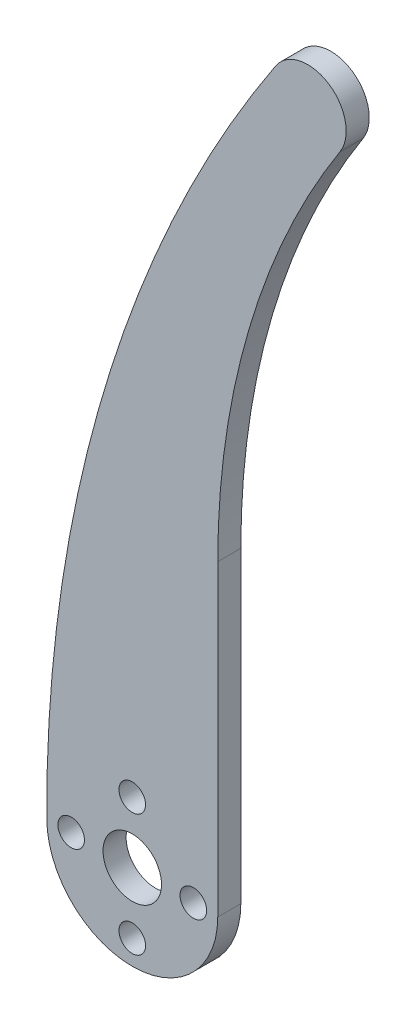
ISO-10303-21;
HEADER;
FILE_DESCRIPTION(('STEP AP214'),'2;1');
FILE_NAME('part.step','',(''),(''),'','','');
FILE_SCHEMA(('AUTOMOTIVE_DESIGN { 1 0 10303 214 1 1 1 1 }'));
ENDSEC;
DATA;
#1=APPLICATION_CONTEXT('core data for automotive mechanical design processes');
#2=APPLICATION_PROTOCOL_DEFINITION('international standard','automotive_design',2000,#1);
#3=PRODUCT_CONTEXT('',#1,'mechanical');
#4=PRODUCT('Part','Part','',(#3));
#5=PRODUCT_RELATED_PRODUCT_CATEGORY('part','',(#4));
#6=PRODUCT_DEFINITION_FORMATION('','',#4);
#7=PRODUCT_DEFINITION_CONTEXT('part definition',#1,'design');
#8=PRODUCT_DEFINITION('design','',#6,#7);
#9=PRODUCT_DEFINITION_SHAPE('','',#8);
#10=(LENGTH_UNIT() NAMED_UNIT(*) SI_UNIT(.MILLI.,.METRE.));
#11=(NAMED_UNIT(*) PLANE_ANGLE_UNIT() SI_UNIT($,.RADIAN.));
#12=(NAMED_UNIT(*) SI_UNIT($,.STERADIAN.) SOLID_ANGLE_UNIT());
#13=UNCERTAINTY_MEASURE_WITH_UNIT(LENGTH_MEASURE(1.E-05),#10,'distance_accuracy_value','');
#14=(GEOMETRIC_REPRESENTATION_CONTEXT(3) GLOBAL_UNCERTAINTY_ASSIGNED_CONTEXT((#13)) GLOBAL_UNIT_ASSIGNED_CONTEXT((#10,
#11,#12)) REPRESENTATION_CONTEXT('',''));
#15=CARTESIAN_POINT('',(0.,0.,0.));
#16=DIRECTION('',(0.,0.,1.));
#17=DIRECTION('',(1.,0.,0.));
#18=AXIS2_PLACEMENT_3D('',#15,#16,#17);
#19=CARTESIAN_POINT('',(167.676375143913,0.808952693949483,3.));
#20=DIRECTION('',(0.,0.,-1.));
#21=DIRECTION('',(-1.,0.,0.));
#22=AXIS2_PLACEMENT_3D('',#19,#20,#21);
#23=CYLINDRICAL_SURFACE('',#22,178.790826523923);
#24=CARTESIAN_POINT('',(167.676375143913,0.808952693949483,0.));
#25=DIRECTION('',(0.,0.,1.));
#26=DIRECTION('',(1.,0.,0.));
#27=AXIS2_PLACEMENT_3D('',#24,#25,#26);
#28=CIRCLE('',#27,178.790826523923);
#29=CARTESIAN_POINT('',(18.635346270872,99.5658833954088,0.));
#30=VERTEX_POINT('',#29);
#31=CARTESIAN_POINT('',(-11.1123706767248,-0.0536115012468871,0.));
#32=VERTEX_POINT('',#31);
#33=EDGE_CURVE('E106',#30,#32,#28,.T.);
#34=ORIENTED_EDGE('',*,*,#33,.T.);
#35=DIRECTION('',(0.,0.,-1.));
#36=VECTOR('',#35,1.);
#37=CARTESIAN_POINT('',(-11.1123706767248,-0.0536115012468871,3.));
#38=LINE('',#37,#36);
#39=CARTESIAN_POINT('',(-11.1123706767248,-0.0536115012468871,3.));
#40=VERTEX_POINT('',#39);
#41=EDGE_CURVE('E11',#40,#32,#38,.T.);
#42=ORIENTED_EDGE('',*,*,#41,.F.);
#43=CARTESIAN_POINT('',(167.676375143913,0.808952693949483,3.));
#44=DIRECTION('',(0.,0.,1.));
#45=DIRECTION('',(1.,0.,0.));
#46=AXIS2_PLACEMENT_3D('',#43,#44,#45);
#47=CIRCLE('',#46,178.790826523923);
#48=CARTESIAN_POINT('',(18.635346270872,99.5658833954088,3.));
#49=VERTEX_POINT('',#48);
#50=EDGE_CURVE('E115',#49,#40,#47,.T.);
#51=ORIENTED_EDGE('',*,*,#50,.F.);
#52=DIRECTION('',(0.,0.,-1.));
#53=VECTOR('',#52,1.);
#54=CARTESIAN_POINT('',(18.635346270872,99.5658833954088,3.));
#55=LINE('',#54,#53);
#56=EDGE_CURVE('E102',#49,#30,#55,.T.);
#57=ORIENTED_EDGE('',*,*,#56,.T.);
#58=EDGE_LOOP('',(#34,#42,#51,#57));
#59=FACE_BOUND('',#58,.T.);
#60=ADVANCED_FACE('F31',(#59),#23,.T.);
#61=CARTESIAN_POINT('',(0.,0.,3.));
#62=DIRECTION('',(0.,0.,-1.));
#63=DIRECTION('',(-1.,0.,0.));
#64=AXIS2_PLACEMENT_3D('',#61,#62,#63);
#65=CYLINDRICAL_SURFACE('',#64,11.1125);
#66=CARTESIAN_POINT('',(0.,0.,0.));
#67=DIRECTION('',(0.,0.,1.));
#68=DIRECTION('',(1.,0.,0.));
#69=AXIS2_PLACEMENT_3D('',#66,#67,#68);
#70=CIRCLE('',#69,11.1125);
#71=CARTESIAN_POINT('',(11.1125,0.,0.));
#72=VERTEX_POINT('',#71);
#73=EDGE_CURVE('E109',#32,#72,#70,.T.);
#74=ORIENTED_EDGE('',*,*,#73,.T.);
#75=DIRECTION('',(0.,0.,-1.));
#76=VECTOR('',#75,1.);
#77=CARTESIAN_POINT('',(11.1125,0.,3.));
#78=LINE('',#77,#76);
#79=CARTESIAN_POINT('',(11.1125,0.,3.));
#80=VERTEX_POINT('',#79);
#81=EDGE_CURVE('E40',#80,#72,#78,.T.);
#82=ORIENTED_EDGE('',*,*,#81,.F.);
#83=CARTESIAN_POINT('',(0.,0.,3.));
#84=DIRECTION('',(0.,0.,1.));
#85=DIRECTION('',(1.,0.,0.));
#86=AXIS2_PLACEMENT_3D('',#83,#84,#85);
#87=CIRCLE('',#86,11.1125);
#88=EDGE_CURVE('E82',#40,#80,#87,.T.);
#89=ORIENTED_EDGE('',*,*,#88,.F.);
#90=ORIENTED_EDGE('',*,*,#41,.T.);
#91=EDGE_LOOP('',(#74,#82,#89,#90));
#92=FACE_BOUND('',#91,.T.);
#93=ADVANCED_FACE('F136',(#92),#65,.T.);
#94=CARTESIAN_POINT('',(11.1125,0.,3.));
#95=DIRECTION('',(-1.,0.,0.));
#96=DIRECTION('',(0.,0.,1.));
#97=AXIS2_PLACEMENT_3D('',#94,#95,#96);
#98=PLANE('',#97);
#99=DIRECTION('',(0.,1.,0.));
#100=VECTOR('',#99,1.);
#101=CARTESIAN_POINT('',(11.1125,0.,0.));
#102=LINE('',#101,#100);
#103=CARTESIAN_POINT('',(11.1125,40.,0.));
#104=VERTEX_POINT('',#103);
#105=EDGE_CURVE('E97',#72,#104,#102,.T.);
#106=ORIENTED_EDGE('',*,*,#105,.T.);
#107=DIRECTION('',(0.,0.,-1.));
#108=VECTOR('',#107,1.);
#109=CARTESIAN_POINT('',(11.1125,40.,3.));
#110=LINE('',#109,#108);
#111=CARTESIAN_POINT('',(11.1125,40.,3.));
#112=VERTEX_POINT('',#111);
#113=EDGE_CURVE('E94',#112,#104,#110,.T.);
#114=ORIENTED_EDGE('',*,*,#113,.F.);
#115=DIRECTION('',(0.,1.,0.));
#116=VECTOR('',#115,1.);
#117=CARTESIAN_POINT('',(11.1125,0.,3.));
#118=LINE('',#117,#116);
#119=EDGE_CURVE('E86',#80,#112,#118,.T.);
#120=ORIENTED_EDGE('',*,*,#119,.F.);
#121=ORIENTED_EDGE('',*,*,#81,.T.);
#122=EDGE_LOOP('',(#106,#114,#120,#121));
#123=FACE_BOUND('',#122,.T.);
#124=ADVANCED_FACE('F95',(#123),#98,.F.);
#125=CARTESIAN_POINT('',(111.1125,40.,3.));
#126=DIRECTION('',(0.,0.,-1.));
#127=DIRECTION('',(-1.,0.,0.));
#128=AXIS2_PLACEMENT_3D('',#125,#126,#127);
#129=CYLINDRICAL_SURFACE('',#128,100.);
#130=CARTESIAN_POINT('',(111.1125,40.,0.));
#131=DIRECTION('',(0.,0.,-1.));
#132=DIRECTION('',(-1.,0.,0.));
#133=AXIS2_PLACEMENT_3D('',#130,#131,#132);
#134=CIRCLE('',#133,100.);
#135=CARTESIAN_POINT('',(27.0093510174704,94.0986167218945,0.));
#136=VERTEX_POINT('',#135);
#137=EDGE_CURVE('E68',#104,#136,#134,.T.);
#138=ORIENTED_EDGE('',*,*,#137,.T.);
#139=DIRECTION('',(0.,0.,-1.));
#140=VECTOR('',#139,1.);
#141=CARTESIAN_POINT('',(27.0093510174704,94.0986167218945,3.));
#142=LINE('',#141,#140);
#143=CARTESIAN_POINT('',(27.0093510174704,94.0986167218945,3.));
#144=VERTEX_POINT('',#143);
#145=EDGE_CURVE('E98',#144,#136,#142,.T.);
#146=ORIENTED_EDGE('',*,*,#145,.F.);
#147=CARTESIAN_POINT('',(111.1125,40.,3.));
#148=DIRECTION('',(0.,0.,-1.));
#149=DIRECTION('',(-1.,0.,0.));
#150=AXIS2_PLACEMENT_3D('',#147,#148,#149);
#151=CIRCLE('',#150,100.);
#152=EDGE_CURVE('E90',#112,#144,#151,.T.);
#153=ORIENTED_EDGE('',*,*,#152,.F.);
#154=ORIENTED_EDGE('',*,*,#113,.T.);
#155=EDGE_LOOP('',(#138,#146,#153,#154));
#156=FACE_BOUND('',#155,.T.);
#157=ADVANCED_FACE('F100',(#156),#129,.F.);
#158=CARTESIAN_POINT('',(22.8037820280012,96.8038122777237,3.));
#159=DIRECTION('',(0.,0.,-1.));
#160=DIRECTION('',(-1.,0.,0.));
#161=AXIS2_PLACEMENT_3D('',#158,#159,#160);
#162=CYLINDRICAL_SURFACE('',#161,5.00048932810211);
#163=CARTESIAN_POINT('',(22.8037820280012,96.8038122777237,0.));
#164=DIRECTION('',(0.,0.,1.));
#165=DIRECTION('',(1.,0.,0.));
#166=AXIS2_PLACEMENT_3D('',#163,#164,#165);
#167=CIRCLE('',#166,5.00048932810211);
#168=EDGE_CURVE('E74',#136,#30,#167,.T.);
#169=ORIENTED_EDGE('',*,*,#168,.T.);
#170=ORIENTED_EDGE('',*,*,#56,.F.);
#171=CARTESIAN_POINT('',(22.8037820280012,96.8038122777237,3.));
#172=DIRECTION('',(0.,0.,1.));
#173=DIRECTION('',(1.,0.,0.));
#174=AXIS2_PLACEMENT_3D('',#171,#172,#173);
#175=CIRCLE('',#174,5.00048932810211);
#176=EDGE_CURVE('E48',#144,#49,#175,.T.);
#177=ORIENTED_EDGE('',*,*,#176,.F.);
#178=ORIENTED_EDGE('',*,*,#145,.T.);
#179=EDGE_LOOP('',(#169,#170,#177,#178));
#180=FACE_BOUND('',#179,.T.);
#181=ADVANCED_FACE('F124',(#180),#162,.T.);
#182=CARTESIAN_POINT('',(167.676375143913,0.808952693949483,3.));
#183=DIRECTION('',(0.,0.,1.));
#184=DIRECTION('',(1.,0.,0.));
#185=AXIS2_PLACEMENT_3D('',#182,#183,#184);
#186=PLANE('',#185);
#187=CARTESIAN_POINT('',(0.,0.,3.));
#188=DIRECTION('',(0.,0.,1.));
#189=DIRECTION('',(1.,0.,0.));
#190=AXIS2_PLACEMENT_3D('',#187,#188,#189);
#191=CIRCLE('',#190,3.8);
#192=CARTESIAN_POINT('',(3.8,0.,3.));
#193=VERTEX_POINT('',#192);
#194=EDGE_CURVE('E225',#193,#193,#191,.T.);
#195=ORIENTED_EDGE('',*,*,#194,.F.);
#196=EDGE_LOOP('',(#195));
#197=FACE_BOUND('',#196,.T.);
#198=CARTESIAN_POINT('',(-7.9375,0.,3.));
#199=DIRECTION('',(0.,0.,1.));
#200=DIRECTION('',(1.,0.,0.));
#201=AXIS2_PLACEMENT_3D('',#198,#199,#200);
#202=CIRCLE('',#201,1.72719999999999);
#203=CARTESIAN_POINT('',(-6.21030000000001,0.,3.));
#204=VERTEX_POINT('',#203);
#205=EDGE_CURVE('E228',#204,#204,#202,.T.);
#206=ORIENTED_EDGE('',*,*,#205,.F.);
#207=EDGE_LOOP('',(#206));
#208=FACE_BOUND('',#207,.T.);
#209=CARTESIAN_POINT('',(0.,7.9375,3.));
#210=DIRECTION('',(0.,0.,1.));
#211=DIRECTION('',(1.,0.,0.));
#212=AXIS2_PLACEMENT_3D('',#209,#210,#211);
#213=CIRCLE('',#212,1.72719999999999);
#214=CARTESIAN_POINT('',(1.72719999999999,7.9375,3.));
#215=VERTEX_POINT('',#214);
#216=EDGE_CURVE('E236',#215,#215,#213,.T.);
#217=ORIENTED_EDGE('',*,*,#216,.F.);
#218=EDGE_LOOP('',(#217));
#219=FACE_BOUND('',#218,.T.);
#220=CARTESIAN_POINT('',(7.9375,0.,3.));
#221=DIRECTION('',(0.,0.,1.));
#222=DIRECTION('',(1.,0.,0.));
#223=AXIS2_PLACEMENT_3D('',#220,#221,#222);
#224=CIRCLE('',#223,1.72719999999999);
#225=CARTESIAN_POINT('',(9.66469999999999,0.,3.));
#226=VERTEX_POINT('',#225);
#227=EDGE_CURVE('E242',#226,#226,#224,.T.);
#228=ORIENTED_EDGE('',*,*,#227,.F.);
#229=EDGE_LOOP('',(#228));
#230=FACE_BOUND('',#229,.T.);
#231=CARTESIAN_POINT('',(0.,-7.9375,3.));
#232=DIRECTION('',(0.,0.,1.));
#233=DIRECTION('',(1.,0.,0.));
#234=AXIS2_PLACEMENT_3D('',#231,#232,#233);
#235=CIRCLE('',#234,1.72719999999999);
#236=CARTESIAN_POINT('',(1.72719999999999,-7.9375,3.));
#237=VERTEX_POINT('',#236);
#238=EDGE_CURVE('E248',#237,#237,#235,.T.);
#239=ORIENTED_EDGE('',*,*,#238,.F.);
#240=EDGE_LOOP('',(#239));
#241=FACE_BOUND('',#240,.T.);
#242=ORIENTED_EDGE('',*,*,#50,.T.);
#243=ORIENTED_EDGE('',*,*,#88,.T.);
#244=ORIENTED_EDGE('',*,*,#119,.T.);
#245=ORIENTED_EDGE('',*,*,#152,.T.);
#246=ORIENTED_EDGE('',*,*,#176,.T.);
#247=EDGE_LOOP('',(#242,#243,#244,#245,#246));
#248=FACE_BOUND('',#247,.T.);
#249=ADVANCED_FACE('F88',(#197,#208,#219,#230,#241,#248),#186,.T.);
#250=CARTESIAN_POINT('',(167.676375143913,0.808952693949483,0.));
#251=DIRECTION('',(0.,0.,1.));
#252=DIRECTION('',(1.,0.,0.));
#253=AXIS2_PLACEMENT_3D('',#250,#251,#252);
#254=PLANE('',#253);
#255=CARTESIAN_POINT('',(0.,0.,0.));
#256=DIRECTION('',(0.,0.,1.));
#257=DIRECTION('',(1.,0.,0.));
#258=AXIS2_PLACEMENT_3D('',#255,#256,#257);
#259=CIRCLE('',#258,3.8);
#260=CARTESIAN_POINT('',(3.8,0.,0.));
#261=VERTEX_POINT('',#260);
#262=EDGE_CURVE('E34',#261,#261,#259,.T.);
#263=ORIENTED_EDGE('',*,*,#262,.T.);
#264=EDGE_LOOP('',(#263));
#265=FACE_BOUND('',#264,.T.);
#266=CARTESIAN_POINT('',(-7.9375,0.,0.));
#267=DIRECTION('',(0.,0.,1.));
#268=DIRECTION('',(1.,0.,0.));
#269=AXIS2_PLACEMENT_3D('',#266,#267,#268);
#270=CIRCLE('',#269,1.7272);
#271=CARTESIAN_POINT('',(-6.2103,0.,0.));
#272=VERTEX_POINT('',#271);
#273=EDGE_CURVE('E230',#272,#272,#270,.T.);
#274=ORIENTED_EDGE('',*,*,#273,.T.);
#275=EDGE_LOOP('',(#274));
#276=FACE_BOUND('',#275,.T.);
#277=CARTESIAN_POINT('',(0.,7.9375,0.));
#278=DIRECTION('',(0.,0.,1.));
#279=DIRECTION('',(1.,0.,0.));
#280=AXIS2_PLACEMENT_3D('',#277,#278,#279);
#281=CIRCLE('',#280,1.7272);
#282=CARTESIAN_POINT('',(1.7272,7.9375,0.));
#283=VERTEX_POINT('',#282);
#284=EDGE_CURVE('E239',#283,#283,#281,.T.);
#285=ORIENTED_EDGE('',*,*,#284,.T.);
#286=EDGE_LOOP('',(#285));
#287=FACE_BOUND('',#286,.T.);
#288=CARTESIAN_POINT('',(7.9375,0.,0.));
#289=DIRECTION('',(0.,0.,1.));
#290=DIRECTION('',(1.,0.,0.));
#291=AXIS2_PLACEMENT_3D('',#288,#289,#290);
#292=CIRCLE('',#291,1.7272);
#293=CARTESIAN_POINT('',(9.6647,0.,0.));
#294=VERTEX_POINT('',#293);
#295=EDGE_CURVE('E245',#294,#294,#292,.T.);
#296=ORIENTED_EDGE('',*,*,#295,.T.);
#297=EDGE_LOOP('',(#296));
#298=FACE_BOUND('',#297,.T.);
#299=CARTESIAN_POINT('',(0.,-7.9375,0.));
#300=DIRECTION('',(0.,0.,1.));
#301=DIRECTION('',(1.,0.,0.));
#302=AXIS2_PLACEMENT_3D('',#299,#300,#301);
#303=CIRCLE('',#302,1.7272);
#304=CARTESIAN_POINT('',(1.7272,-7.9375,0.));
#305=VERTEX_POINT('',#304);
#306=EDGE_CURVE('E110',#305,#305,#303,.T.);
#307=ORIENTED_EDGE('',*,*,#306,.T.);
#308=EDGE_LOOP('',(#307));
#309=FACE_BOUND('',#308,.T.);
#310=ORIENTED_EDGE('',*,*,#33,.F.);
#311=ORIENTED_EDGE('',*,*,#168,.F.);
#312=ORIENTED_EDGE('',*,*,#137,.F.);
#313=ORIENTED_EDGE('',*,*,#105,.F.);
#314=ORIENTED_EDGE('',*,*,#73,.F.);
#315=EDGE_LOOP('',(#310,#311,#312,#313,#314));
#316=FACE_BOUND('',#315,.T.);
#317=ADVANCED_FACE('F120',(#265,#276,#287,#298,#309,#316),#254,.F.);
#318=CARTESIAN_POINT('',(0.,-7.9375,3.));
#319=DIRECTION('',(0.,0.,1.));
#320=DIRECTION('',(1.,0.,0.));
#321=AXIS2_PLACEMENT_3D('',#318,#319,#320);
#322=CYLINDRICAL_SURFACE('',#321,1.72719999999999);
#323=ORIENTED_EDGE('',*,*,#306,.F.);
#324=EDGE_LOOP('',(#323));
#325=FACE_BOUND('',#324,.T.);
#326=ORIENTED_EDGE('',*,*,#238,.T.);
#327=EDGE_LOOP('',(#326));
#328=FACE_BOUND('',#327,.T.);
#329=ADVANCED_FACE('F160',(#325,#328),#322,.F.);
#330=CARTESIAN_POINT('',(7.9375,0.,3.));
#331=DIRECTION('',(0.,0.,1.));
#332=DIRECTION('',(1.,0.,0.));
#333=AXIS2_PLACEMENT_3D('',#330,#331,#332);
#334=CYLINDRICAL_SURFACE('',#333,1.72719999999999);
#335=ORIENTED_EDGE('',*,*,#295,.F.);
#336=EDGE_LOOP('',(#335));
#337=FACE_BOUND('',#336,.T.);
#338=ORIENTED_EDGE('',*,*,#227,.T.);
#339=EDGE_LOOP('',(#338));
#340=FACE_BOUND('',#339,.T.);
#341=ADVANCED_FACE('F165',(#337,#340),#334,.F.);
#342=CARTESIAN_POINT('',(0.,7.9375,3.));
#343=DIRECTION('',(0.,0.,1.));
#344=DIRECTION('',(1.,0.,0.));
#345=AXIS2_PLACEMENT_3D('',#342,#343,#344);
#346=CYLINDRICAL_SURFACE('',#345,1.72719999999999);
#347=ORIENTED_EDGE('',*,*,#284,.F.);
#348=EDGE_LOOP('',(#347));
#349=FACE_BOUND('',#348,.T.);
#350=ORIENTED_EDGE('',*,*,#216,.T.);
#351=EDGE_LOOP('',(#350));
#352=FACE_BOUND('',#351,.T.);
#353=ADVANCED_FACE('F177',(#349,#352),#346,.F.);
#354=CARTESIAN_POINT('',(-7.9375,0.,3.));
#355=DIRECTION('',(0.,0.,1.));
#356=DIRECTION('',(1.,0.,0.));
#357=AXIS2_PLACEMENT_3D('',#354,#355,#356);
#358=CYLINDRICAL_SURFACE('',#357,1.72719999999999);
#359=ORIENTED_EDGE('',*,*,#273,.F.);
#360=EDGE_LOOP('',(#359));
#361=FACE_BOUND('',#360,.T.);
#362=ORIENTED_EDGE('',*,*,#205,.T.);
#363=EDGE_LOOP('',(#362));
#364=FACE_BOUND('',#363,.T.);
#365=ADVANCED_FACE('F187',(#361,#364),#358,.F.);
#366=CARTESIAN_POINT('',(0.,0.,3.));
#367=DIRECTION('',(0.,0.,1.));
#368=DIRECTION('',(1.,0.,0.));
#369=AXIS2_PLACEMENT_3D('',#366,#367,#368);
#370=CYLINDRICAL_SURFACE('',#369,3.8);
#371=ORIENTED_EDGE('',*,*,#194,.T.);
#372=EDGE_LOOP('',(#371));
#373=FACE_BOUND('',#372,.T.);
#374=ORIENTED_EDGE('',*,*,#262,.F.);
#375=EDGE_LOOP('',(#374));
#376=FACE_BOUND('',#375,.T.);
#377=ADVANCED_FACE('F197',(#373,#376),#370,.F.);
#378=CLOSED_SHELL('',(#60,#93,#124,#157,#181,#249,#317,#329,#341,#353,#365,#377));
#379=MANIFOLD_SOLID_BREP('B2',#378);
#380=ADVANCED_BREP_SHAPE_REPRESENTATION('',(#18,#379),#14);
#381=SHAPE_DEFINITION_REPRESENTATION(#9,#380);
ENDSEC;
END-ISO-10303-21;
